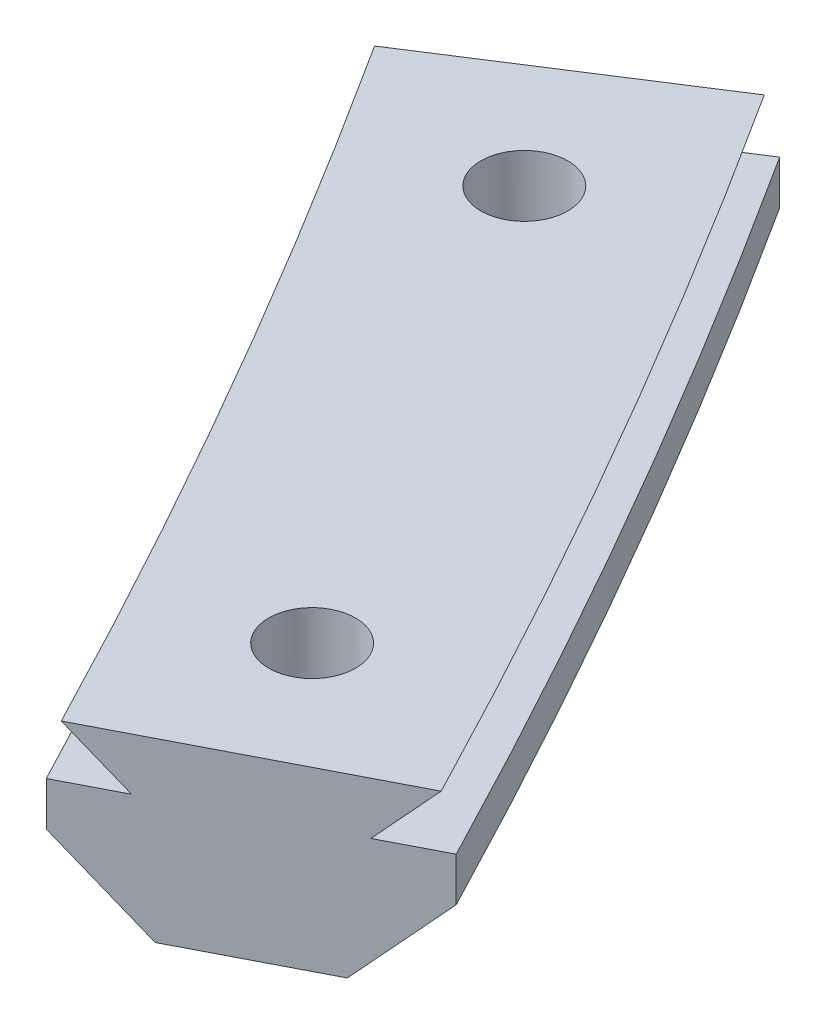
ISO-10303-21;
HEADER;
FILE_DESCRIPTION(('STEP AP214'),'2;1');
FILE_NAME('part.step','',(''),(''),'','','');
FILE_SCHEMA(('AUTOMOTIVE_DESIGN { 1 0 10303 214 1 1 1 1 }'));
ENDSEC;
DATA;
#1=APPLICATION_CONTEXT('core data for automotive mechanical design processes');
#2=APPLICATION_PROTOCOL_DEFINITION('international standard','automotive_design',2000,#1);
#3=PRODUCT_CONTEXT('',#1,'mechanical');
#4=PRODUCT('Part','Part','',(#3));
#5=PRODUCT_RELATED_PRODUCT_CATEGORY('part','',(#4));
#6=PRODUCT_DEFINITION_FORMATION('','',#4);
#7=PRODUCT_DEFINITION_CONTEXT('part definition',#1,'design');
#8=PRODUCT_DEFINITION('design','',#6,#7);
#9=PRODUCT_DEFINITION_SHAPE('','',#8);
#10=(LENGTH_UNIT() NAMED_UNIT(*) SI_UNIT(.MILLI.,.METRE.));
#11=(NAMED_UNIT(*) PLANE_ANGLE_UNIT() SI_UNIT($,.RADIAN.));
#12=(NAMED_UNIT(*) SI_UNIT($,.STERADIAN.) SOLID_ANGLE_UNIT());
#13=UNCERTAINTY_MEASURE_WITH_UNIT(LENGTH_MEASURE(1.E-05),#10,'distance_accuracy_value','');
#14=(GEOMETRIC_REPRESENTATION_CONTEXT(3) GLOBAL_UNCERTAINTY_ASSIGNED_CONTEXT((#13)) GLOBAL_UNIT_ASSIGNED_CONTEXT((#10,
#11,#12)) REPRESENTATION_CONTEXT('',''));
#15=CARTESIAN_POINT('',(0.,0.,0.));
#16=DIRECTION('',(0.,0.,1.));
#17=DIRECTION('',(1.,0.,0.));
#18=AXIS2_PLACEMENT_3D('',#15,#16,#17);
#19=CARTESIAN_POINT('',(581.727271778564,-1.28282801048485E-12,-165.830742679956));
#20=DIRECTION('',(0.,1.,0.));
#21=DIRECTION('',(-1.,0.,0.));
#22=AXIS2_PLACEMENT_3D('',#19,#20,#21);
#23=CYLINDRICAL_SURFACE('',#22,1.49999999999996);
#24=CARTESIAN_POINT('',(581.727271778564,6.09999999999939,-165.830742679956));
#25=DIRECTION('',(0.,1.,0.));
#26=DIRECTION('',(-1.,0.,0.));
#27=AXIS2_PLACEMENT_3D('',#24,#25,#26);
#28=CIRCLE('',#27,1.49999999999996);
#29=CARTESIAN_POINT('',(580.227271778564,6.09999999999939,-165.830742679956));
#30=VERTEX_POINT('',#29);
#31=EDGE_CURVE('E550',#30,#30,#28,.T.);
#32=ORIENTED_EDGE('',*,*,#31,.T.);
#33=EDGE_LOOP('',(#32));
#34=FACE_BOUND('',#33,.T.);
#35=CARTESIAN_POINT('',(581.727271778564,2.99999999999939,-165.830742679956));
#36=DIRECTION('',(0.,-1.,0.));
#37=DIRECTION('',(1.,0.,0.));
#38=AXIS2_PLACEMENT_3D('',#35,#36,#37);
#39=CIRCLE('',#38,1.49999999999996);
#40=CARTESIAN_POINT('',(583.227271778564,2.99999999999939,-165.830742679956));
#41=VERTEX_POINT('',#40);
#42=EDGE_CURVE('E535',#41,#41,#39,.F.);
#43=ORIENTED_EDGE('',*,*,#42,.F.);
#44=EDGE_LOOP('',(#43));
#45=FACE_BOUND('',#44,.T.);
#46=ADVANCED_FACE('F38',(#34,#45),#23,.F.);
#47=CARTESIAN_POINT('',(591.727271778564,-1.29323635134071E-12,-148.510234604267));
#48=DIRECTION('',(0.,1.,0.));
#49=DIRECTION('',(-1.,0.,0.));
#50=AXIS2_PLACEMENT_3D('',#47,#48,#49);
#51=CYLINDRICAL_SURFACE('',#50,1.49999999999996);
#52=CARTESIAN_POINT('',(591.727271778564,6.09999999999938,-148.510234604267));
#53=DIRECTION('',(0.,1.,0.));
#54=DIRECTION('',(-1.,0.,0.));
#55=AXIS2_PLACEMENT_3D('',#52,#53,#54);
#56=CIRCLE('',#55,1.49999999999996);
#57=CARTESIAN_POINT('',(590.227271778564,6.09999999999938,-148.510234604267));
#58=VERTEX_POINT('',#57);
#59=EDGE_CURVE('E522',#58,#58,#56,.T.);
#60=ORIENTED_EDGE('',*,*,#59,.T.);
#61=EDGE_LOOP('',(#60));
#62=FACE_BOUND('',#61,.T.);
#63=CARTESIAN_POINT('',(591.727271778564,2.99999999999938,-148.510234604267));
#64=DIRECTION('',(0.,-1.,0.));
#65=DIRECTION('',(1.,0.,0.));
#66=AXIS2_PLACEMENT_3D('',#63,#64,#65);
#67=CIRCLE('',#66,1.49999999999996);
#68=CARTESIAN_POINT('',(593.227271778564,2.99999999999937,-148.510234604267));
#69=VERTEX_POINT('',#68);
#70=EDGE_CURVE('E437',#69,#69,#67,.F.);
#71=ORIENTED_EDGE('',*,*,#70,.F.);
#72=EDGE_LOOP('',(#71));
#73=FACE_BOUND('',#72,.T.);
#74=ADVANCED_FACE('F449',(#62,#73),#51,.F.);
#75=CARTESIAN_POINT('',(-2.46065352773282,0.,0.));
#76=DIRECTION('',(0.,1.,0.));
#77=DIRECTION('',(-1.,0.,0.));
#78=AXIS2_PLACEMENT_3D('',#75,#76,#77);
#79=PLANE('',#78);
#80=CARTESIAN_POINT('',(314.5,-3.30031141304588E-13,0.));
#81=DIRECTION('',(0.,-1.,0.));
#82=DIRECTION('',(-1.,0.,0.));
#83=AXIS2_PLACEMENT_3D('',#80,#81,#82);
#84=CIRCLE('',#83,316.960653527733);
#85=CARTESIAN_POINT('',(584.79480740583,-6.14814246764911E-13,-165.543870240408));
#86=VERTEX_POINT('',#85);
#87=CARTESIAN_POINT('',(593.012600771902,-6.24799165199513E-13,-151.310234604267));
#88=VERTEX_POINT('',#87);
#89=EDGE_CURVE('E513',#86,#88,#84,.T.);
#90=ORIENTED_EDGE('',*,*,#89,.T.);
#91=DIRECTION('',(1.,0.,0.));
#92=VECTOR('',#91,1.);
#93=CARTESIAN_POINT('',(590.110691024833,-6.21741707760846E-13,-151.310234604267));
#94=LINE('',#93,#92);
#95=CARTESIAN_POINT('',(590.110691024833,-6.21741707760846E-13,-151.310234604267));
#96=VERTEX_POINT('',#95);
#97=EDGE_CURVE('E245',#96,#88,#94,.T.);
#98=ORIENTED_EDGE('',*,*,#97,.F.);
#99=DIRECTION('',(-0.500000000000013,0.,0.866025403784431));
#100=VECTOR('',#99,1.);
#101=CARTESIAN_POINT('',(376.448601376743,-3.92293517173956E-13,218.763360317548));
#102=LINE('',#101,#100);
#103=CARTESIAN_POINT('',(588.720274830606,-6.20276762705206E-13,-148.901963112199));
#104=VERTEX_POINT('',#103);
#105=EDGE_CURVE('E529',#96,#104,#102,.T.);
#106=ORIENTED_EDGE('',*,*,#105,.T.);
#107=CARTESIAN_POINT('',(314.5,-3.23959609138669E-13,0.));
#108=DIRECTION('',(0.,-1.,0.));
#109=DIRECTION('',(-1.,0.,0.));
#110=AXIS2_PLACEMENT_3D('',#107,#108,#109);
#111=CIRCLE('',#110,312.039346472267);
#112=CARTESIAN_POINT('',(580.563020143841,-6.11682264187002E-13,-163.030742679955));
#113=VERTEX_POINT('',#112);
#114=EDGE_CURVE('E586',#113,#104,#111,.T.);
#115=ORIENTED_EDGE('',*,*,#114,.F.);
#116=DIRECTION('',(-1.,0.,0.));
#117=VECTOR('',#116,1.);
#118=CARTESIAN_POINT('',(583.343852532295,-6.14612154298281E-13,-163.030742679955));
#119=LINE('',#118,#117);
#120=CARTESIAN_POINT('',(583.343852532295,-6.14612154298281E-13,-163.030742679955));
#121=VERTEX_POINT('',#120);
#122=EDGE_CURVE('E308',#121,#113,#119,.T.);
#123=ORIENTED_EDGE('',*,*,#122,.F.);
#124=DIRECTION('',(0.499999999999995,0.,-0.866025403784442));
#125=VECTOR('',#124,1.);
#126=CARTESIAN_POINT('',(366.298343637949,-3.81599186980123E-13,212.9031062797));
#127=LINE('',#126,#125);
#128=EDGE_CURVE('E518',#121,#86,#127,.T.);
#129=ORIENTED_EDGE('',*,*,#128,.T.);
#130=EDGE_LOOP('',(#90,#98,#106,#115,#123,#129));
#131=FACE_BOUND('',#130,.T.);
#132=ADVANCED_FACE('F456',(#131),#79,.F.);
#133=CARTESIAN_POINT('',(581.126978647833,-6.10949815649774E-13,-171.388769007353));
#134=VERTEX_POINT('',#133);
#135=CARTESIAN_POINT('',(582.879821350142,-6.14123250192604E-13,-168.630742679956));
#136=VERTEX_POINT('',#135);
#137=EDGE_CURVE('E506',#134,#136,#84,.T.);
#138=ORIENTED_EDGE('',*,*,#137,.T.);
#139=DIRECTION('',(1.,0.,0.));
#140=VECTOR('',#139,1.);
#141=CARTESIAN_POINT('',(580.110691024833,-6.11205689396544E-13,-168.630742679956));
#142=LINE('',#141,#140);
#143=CARTESIAN_POINT('',(580.110691024833,-6.11205689396544E-13,-168.630742679956));
#144=VERTEX_POINT('',#143);
#145=EDGE_CURVE('E287',#144,#136,#142,.T.);
#146=ORIENTED_EDGE('',*,*,#145,.F.);
#147=DIRECTION('',(-0.499999999999984,0.,0.866025403784448));
#148=VECTOR('',#147,1.);
#149=CARTESIAN_POINT('',(361.448601376763,-3.76489489627524E-13,210.103106279698));
#150=LINE('',#149,#148);
#151=CARTESIAN_POINT('',(578.653507789658,-6.09670398463949E-13,-166.106827280695));
#152=VERTEX_POINT('',#151);
#153=EDGE_CURVE('E521',#144,#152,#150,.T.);
#154=ORIENTED_EDGE('',*,*,#153,.T.);
#155=CARTESIAN_POINT('',(576.9871801694,-6.00516584204528E-13,-168.727691839711));
#156=VERTEX_POINT('',#155);
#157=EDGE_CURVE('E582',#156,#152,#111,.T.);
#158=ORIENTED_EDGE('',*,*,#157,.F.);
#159=DIRECTION('',(0.84119898063153,0.,-0.540725692920611));
#160=VECTOR('',#159,1.);
#161=CARTESIAN_POINT('',(90.2136573525786,0.,144.172057780678));
#162=LINE('',#161,#160);
#163=EDGE_CURVE('E614',#156,#134,#162,.T.);
#164=ORIENTED_EDGE('',*,*,#163,.T.);
#165=EDGE_LOOP('',(#138,#146,#154,#158,#164));
#166=FACE_BOUND('',#165,.T.);
#167=ADVANCED_FACE('F708',(#166),#79,.F.);
#168=CARTESIAN_POINT('',(91.9548544826173,0.,143.052810080277));
#169=DIRECTION('',(0.540725692920611,0.,0.84119898063153));
#170=DIRECTION('',(0.84119898063153,0.,-0.540725692920611));
#171=AXIS2_PLACEMENT_3D('',#168,#169,#170);
#172=PLANE('',#171);
#173=DIRECTION('',(0.,-1.,0.));
#174=VECTOR('',#173,1.);
#175=CARTESIAN_POINT('',(574.640784760301,2.78934647226654,-167.219420535699));
#176=LINE('',#175,#174);
#177=CARTESIAN_POINT('',(574.640784760301,4.2999999999994,-167.219420535699));
#178=VERTEX_POINT('',#177);
#179=CARTESIAN_POINT('',(574.640784760301,2.78934647226655,-167.219420535699));
#180=VERTEX_POINT('',#179);
#181=EDGE_CURVE('E722',#178,#180,#176,.T.);
#182=ORIENTED_EDGE('',*,*,#181,.F.);
#183=DIRECTION('',(-0.84119898063153,0.,0.540725692920611));
#184=VECTOR('',#183,1.);
#185=CARTESIAN_POINT('',(95.6698370389488,4.2999999999999,140.664806096425));
#186=LINE('',#185,#184);
#187=CARTESIAN_POINT('',(576.47880453298,4.29999999999934,-168.40090617473));
#188=VERTEX_POINT('',#187);
#189=EDGE_CURVE('E645',#188,#178,#186,.T.);
#190=ORIENTED_EDGE('',*,*,#189,.F.);
#191=DIRECTION('',(-0.594817503531769,0.707106781186544,0.382350804225961));
#192=VECTOR('',#191,1.);
#193=CARTESIAN_POINT('',(314.5,315.734999999996,0.));
#194=LINE('',#193,#192);
#195=CARTESIAN_POINT('',(574.964646367844,6.0999999999994,-167.427599927473));
#196=VERTEX_POINT('',#195);
#197=EDGE_CURVE('E641',#196,#188,#194,.F.);
#198=ORIENTED_EDGE('',*,*,#197,.F.);
#199=DIRECTION('',(-0.84119898063153,0.,0.540725692920611));
#200=VECTOR('',#199,1.);
#201=CARTESIAN_POINT('',(95.3974049848178,6.0999999999999,140.839926388574));
#202=LINE('',#201,#200);
#203=CARTESIAN_POINT('',(583.149512449389,6.09999999999938,-172.688860919591));
#204=VERTEX_POINT('',#203);
#205=EDGE_CURVE('E635',#204,#196,#202,.T.);
#206=ORIENTED_EDGE('',*,*,#205,.F.);
#207=DIRECTION('',(0.594817503531772,0.707106781186541,-0.382350804225962));
#208=VECTOR('',#207,1.);
#209=CARTESIAN_POINT('',(314.5,-313.264999999995,0.));
#210=LINE('',#209,#208);
#211=CARTESIAN_POINT('',(581.635354284252,4.29999999999939,-171.715554672334));
#212=VERTEX_POINT('',#211);
#213=EDGE_CURVE('E712',#212,#204,#210,.T.);
#214=ORIENTED_EDGE('',*,*,#213,.F.);
#215=DIRECTION('',(-0.84119898063153,0.,0.540725692920611));
#216=VECTOR('',#215,1.);
#217=CARTESIAN_POINT('',(88.2398719262858,4.2999999999999,145.440814064129));
#218=LINE('',#217,#216);
#219=CARTESIAN_POINT('',(583.473374056932,4.29999999999938,-172.897040311365));
#220=VERTEX_POINT('',#219);
#221=EDGE_CURVE('E607',#220,#212,#218,.T.);
#222=ORIENTED_EDGE('',*,*,#221,.F.);
#223=DIRECTION('',(0.,-1.,0.));
#224=VECTOR('',#223,1.);
#225=CARTESIAN_POINT('',(583.473374056932,2.78934647226653,-172.897040311365));
#226=LINE('',#225,#224);
#227=CARTESIAN_POINT('',(583.473374056932,2.78934647226653,-172.897040311365));
#228=VERTEX_POINT('',#227);
#229=EDGE_CURVE('E498',#228,#220,#226,.F.);
#230=ORIENTED_EDGE('',*,*,#229,.F.);
#231=DIRECTION('',(0.594817503531767,0.707106781186547,-0.382350804225959));
#232=VECTOR('',#231,1.);
#233=CARTESIAN_POINT('',(314.5,-316.960653527733,0.));
#234=LINE('',#233,#232);
#235=EDGE_CURVE('E618',#134,#228,#234,.T.);
#236=ORIENTED_EDGE('',*,*,#235,.F.);
#237=ORIENTED_EDGE('',*,*,#163,.F.);
#238=DIRECTION('',(-0.594817503531765,0.707106781186549,0.382350804225958));
#239=VECTOR('',#238,1.);
#240=CARTESIAN_POINT('',(314.5,312.039346472268,0.));
#241=LINE('',#240,#239);
#242=EDGE_CURVE('E438',#180,#156,#241,.F.);
#243=ORIENTED_EDGE('',*,*,#242,.F.);
#244=EDGE_LOOP('',(#182,#190,#198,#206,#214,#222,#230,#236,#237,#243));
#245=FACE_BOUND('',#244,.T.);
#246=ADVANCED_FACE('F365',(#245),#172,.F.);
#247=CARTESIAN_POINT('',(66.0102051464209,0.,128.073659801994));
#248=DIRECTION('',(0.458136840404174,0.,0.888881676863957));
#249=DIRECTION('',(0.888881676863957,0.,-0.458136840404174));
#250=AXIS2_PLACEMENT_3D('',#247,#248,#249);
#251=PLANE('',#250);
#252=DIRECTION('',(0.,-1.,0.));
#253=VECTOR('',#252,1.);
#254=CARTESIAN_POINT('',(589.386658570179,2.78934647226653,-141.678817894991));
#255=LINE('',#254,#253);
#256=CARTESIAN_POINT('',(589.386658570179,4.29999999999938,-141.678817894991));
#257=VERTEX_POINT('',#256);
#258=CARTESIAN_POINT('',(589.386658570179,2.78934647226653,-141.678817894991));
#259=VERTEX_POINT('',#258);
#260=EDGE_CURVE('E575',#257,#259,#255,.T.);
#261=ORIENTED_EDGE('',*,*,#260,.T.);
#262=DIRECTION('',(-0.628534261382972,0.707106781186549,0.32395166656117));
#263=VECTOR('',#262,1.);
#264=CARTESIAN_POINT('',(314.5,312.039346472268,1.12529409619818E-13));
#265=LINE('',#264,#263);
#266=CARTESIAN_POINT('',(591.866057539802,-6.16192996726003E-13,-142.956720274588));
#267=VERTEX_POINT('',#266);
#268=EDGE_CURVE('E579',#259,#267,#265,.F.);
#269=ORIENTED_EDGE('',*,*,#268,.T.);
#270=DIRECTION('',(0.888881676863957,0.,-0.458136840404174));
#271=VECTOR('',#270,1.);
#272=CARTESIAN_POINT('',(64.066016623966,0.,129.07571036734));
#273=LINE('',#272,#271);
#274=CARTESIAN_POINT('',(596.240517207627,-6.26873467631332E-13,-145.211352339638));
#275=VERTEX_POINT('',#274);
#276=EDGE_CURVE('E538',#267,#275,#273,.T.);
#277=ORIENTED_EDGE('',*,*,#276,.T.);
#278=DIRECTION('',(0.628534261382975,0.707106781186547,-0.32395166656117));
#279=VECTOR('',#278,1.);
#280=CARTESIAN_POINT('',(314.5,-316.960653527733,1.12529409619818E-13));
#281=LINE('',#280,#279);
#282=CARTESIAN_POINT('',(598.71991617725,2.78934647226648,-146.489254719234));
#283=VERTEX_POINT('',#282);
#284=EDGE_CURVE('E543',#275,#283,#281,.T.);
#285=ORIENTED_EDGE('',*,*,#284,.T.);
#286=DIRECTION('',(0.,-1.,0.));
#287=VECTOR('',#286,1.);
#288=CARTESIAN_POINT('',(598.71991617725,2.78934647226652,-146.489254719234));
#289=LINE('',#288,#287);
#290=CARTESIAN_POINT('',(598.71991617725,4.29999999999936,-146.489254719234));
#291=VERTEX_POINT('',#290);
#292=EDGE_CURVE('E501',#283,#291,#289,.F.);
#293=ORIENTED_EDGE('',*,*,#292,.T.);
#294=DIRECTION('',(-0.888881676863957,0.,0.458136840404174));
#295=VECTOR('',#294,1.);
#296=CARTESIAN_POINT('',(61.8621243102324,4.29999999999993,130.211614377385));
#297=LINE('',#296,#295);
#298=CARTESIAN_POINT('',(596.777709713303,4.29999999999937,-145.488225722951));
#299=VERTEX_POINT('',#298);
#300=EDGE_CURVE('E555',#291,#299,#297,.T.);
#301=ORIENTED_EDGE('',*,*,#300,.T.);
#302=DIRECTION('',(0.62853426138298,0.707106781186541,-0.323951666561173));
#303=VECTOR('',#302,1.);
#304=CARTESIAN_POINT('',(314.5,-313.264999999995,1.12529409619818E-13));
#305=LINE('',#304,#303);
#306=CARTESIAN_POINT('',(598.377696731658,6.09999999999933,-146.312872035679));
#307=VERTEX_POINT('',#306);
#308=EDGE_CURVE('E559',#299,#307,#305,.T.);
#309=ORIENTED_EDGE('',*,*,#308,.T.);
#310=DIRECTION('',(-0.888881676863957,0.,0.458136840404174));
#311=VECTOR('',#310,1.);
#312=CARTESIAN_POINT('',(69.8540933879556,6.09999999999993,126.092488562131));
#313=LINE('',#312,#311);
#314=CARTESIAN_POINT('',(589.728878015771,6.09999999999939,-141.855200578546));
#315=VERTEX_POINT('',#314);
#316=EDGE_CURVE('E563',#307,#315,#313,.T.);
#317=ORIENTED_EDGE('',*,*,#316,.T.);
#318=DIRECTION('',(-0.628534261382977,0.707106781186544,0.323951666561172));
#319=VECTOR('',#318,1.);
#320=CARTESIAN_POINT('',(314.5,315.734999999996,1.12529409619818E-13));
#321=LINE('',#320,#319);
#322=CARTESIAN_POINT('',(591.328865034127,4.29999999999939,-142.679846891274));
#323=VERTEX_POINT('',#322);
#324=EDGE_CURVE('E567',#315,#323,#321,.F.);
#325=ORIENTED_EDGE('',*,*,#324,.T.);
#326=DIRECTION('',(-0.888881676863957,0.,0.458136840404174));
#327=VECTOR('',#326,1.);
#328=CARTESIAN_POINT('',(70.1582859826094,4.29999999999993,125.935705226603));
#329=LINE('',#328,#327);
#330=EDGE_CURVE('E571',#323,#257,#329,.T.);
#331=ORIENTED_EDGE('',*,*,#330,.T.);
#332=EDGE_LOOP('',(#261,#269,#277,#285,#293,#301,#309,#317,#325,#331));
#333=FACE_BOUND('',#332,.T.);
#334=ADVANCED_FACE('F461',(#333),#251,.T.);
#335=CARTESIAN_POINT('',(314.5,2.78934647226682,0.));
#336=DIRECTION('',(0.,-1.,0.));
#337=DIRECTION('',(1.,0.,0.));
#338=AXIS2_PLACEMENT_3D('',#335,#336,#337);
#339=CYLINDRICAL_SURFACE('',#338,309.25);
#340=CARTESIAN_POINT('',(314.5,4.29999999999967,0.));
#341=DIRECTION('',(0.,-1.,0.));
#342=DIRECTION('',(-1.,0.,0.));
#343=AXIS2_PLACEMENT_3D('',#340,#341,#342);
#344=CIRCLE('',#343,309.25);
#345=EDGE_CURVE('E591',#178,#257,#344,.T.);
#346=ORIENTED_EDGE('',*,*,#345,.F.);
#347=ORIENTED_EDGE('',*,*,#181,.T.);
#348=CARTESIAN_POINT('',(314.5,2.78934647226682,0.));
#349=DIRECTION('',(0.,-1.,0.));
#350=DIRECTION('',(-1.,0.,0.));
#351=AXIS2_PLACEMENT_3D('',#348,#349,#350);
#352=CIRCLE('',#351,309.25);
#353=EDGE_CURVE('E588',#180,#259,#352,.T.);
#354=ORIENTED_EDGE('',*,*,#353,.T.);
#355=ORIENTED_EDGE('',*,*,#260,.F.);
#356=EDGE_LOOP('',(#346,#347,#354,#355));
#357=FACE_BOUND('',#356,.T.);
#358=ADVANCED_FACE('F364',(#357),#339,.F.);
#359=CARTESIAN_POINT('',(5.25,4.3,0.));
#360=DIRECTION('',(0.,-1.,0.));
#361=DIRECTION('',(1.,0.,0.));
#362=AXIS2_PLACEMENT_3D('',#359,#360,#361);
#363=PLANE('',#362);
#364=CARTESIAN_POINT('',(314.5,4.29999999999967,0.));
#365=DIRECTION('',(0.,-1.,0.));
#366=DIRECTION('',(-1.,0.,0.));
#367=AXIS2_PLACEMENT_3D('',#364,#365,#366);
#368=CIRCLE('',#367,311.435);
#369=EDGE_CURVE('E594',#188,#323,#368,.T.);
#370=ORIENTED_EDGE('',*,*,#369,.F.);
#371=ORIENTED_EDGE('',*,*,#189,.T.);
#372=ORIENTED_EDGE('',*,*,#345,.T.);
#373=ORIENTED_EDGE('',*,*,#330,.F.);
#374=EDGE_LOOP('',(#370,#371,#372,#373));
#375=FACE_BOUND('',#374,.T.);
#376=ADVANCED_FACE('F467',(#375),#363,.F.);
#377=CARTESIAN_POINT('',(314.5,4.29999999999967,0.));
#378=DIRECTION('',(0.,-1.,0.));
#379=DIRECTION('',(1.,0.,0.));
#380=AXIS2_PLACEMENT_3D('',#377,#378,#379);
#381=CONICAL_SURFACE('',#380,311.435,0.785398163397454);
#382=CARTESIAN_POINT('',(314.5,6.09999999999968,0.));
#383=DIRECTION('',(0.,-1.,0.));
#384=DIRECTION('',(-1.,0.,0.));
#385=AXIS2_PLACEMENT_3D('',#382,#383,#384);
#386=CIRCLE('',#385,309.635);
#387=EDGE_CURVE('E597',#196,#315,#386,.T.);
#388=ORIENTED_EDGE('',*,*,#387,.F.);
#389=ORIENTED_EDGE('',*,*,#197,.T.);
#390=ORIENTED_EDGE('',*,*,#369,.T.);
#391=ORIENTED_EDGE('',*,*,#324,.F.);
#392=EDGE_LOOP('',(#388,#389,#390,#391));
#393=FACE_BOUND('',#392,.T.);
#394=ADVANCED_FACE('F471',(#393),#381,.F.);
#395=CARTESIAN_POINT('',(4.86500000000002,6.09999999999999,0.));
#396=DIRECTION('',(0.,-1.,0.));
#397=DIRECTION('',(1.,0.,0.));
#398=AXIS2_PLACEMENT_3D('',#395,#396,#397);
#399=PLANE('',#398);
#400=ORIENTED_EDGE('',*,*,#59,.F.);
#401=EDGE_LOOP('',(#400));
#402=FACE_BOUND('',#401,.T.);
#403=ORIENTED_EDGE('',*,*,#31,.F.);
#404=EDGE_LOOP('',(#403));
#405=FACE_BOUND('',#404,.T.);
#406=CARTESIAN_POINT('',(314.5,6.09999999999966,0.));
#407=DIRECTION('',(0.,-1.,0.));
#408=DIRECTION('',(-1.,0.,0.));
#409=AXIS2_PLACEMENT_3D('',#406,#407,#408);
#410=CIRCLE('',#409,319.365);
#411=EDGE_CURVE('E600',#204,#307,#410,.T.);
#412=ORIENTED_EDGE('',*,*,#411,.F.);
#413=ORIENTED_EDGE('',*,*,#205,.T.);
#414=ORIENTED_EDGE('',*,*,#387,.T.);
#415=ORIENTED_EDGE('',*,*,#316,.F.);
#416=EDGE_LOOP('',(#412,#413,#414,#415));
#417=FACE_BOUND('',#416,.T.);
#418=ADVANCED_FACE('F475',(#402,#405,#417),#399,.F.);
#419=CARTESIAN_POINT('',(314.5,6.09999999999966,0.));
#420=DIRECTION('',(0.,1.,0.));
#421=DIRECTION('',(-1.,0.,0.));
#422=AXIS2_PLACEMENT_3D('',#419,#420,#421);
#423=CONICAL_SURFACE('',#422,319.365,0.785398163397456);
#424=CARTESIAN_POINT('',(314.5,4.29999999999967,0.));
#425=DIRECTION('',(0.,-1.,0.));
#426=DIRECTION('',(-1.,0.,0.));
#427=AXIS2_PLACEMENT_3D('',#424,#425,#426);
#428=CIRCLE('',#427,317.565);
#429=EDGE_CURVE('E510',#212,#299,#428,.T.);
#430=ORIENTED_EDGE('',*,*,#429,.F.);
#431=ORIENTED_EDGE('',*,*,#213,.T.);
#432=ORIENTED_EDGE('',*,*,#411,.T.);
#433=ORIENTED_EDGE('',*,*,#308,.F.);
#434=EDGE_LOOP('',(#430,#431,#432,#433));
#435=FACE_BOUND('',#434,.T.);
#436=ADVANCED_FACE('F479',(#435),#423,.T.);
#437=CARTESIAN_POINT('',(-5.25,4.3,0.));
#438=DIRECTION('',(0.,-1.,0.));
#439=DIRECTION('',(1.,0.,0.));
#440=AXIS2_PLACEMENT_3D('',#437,#438,#439);
#441=PLANE('',#440);
#442=CARTESIAN_POINT('',(314.5,4.29999999999966,0.));
#443=DIRECTION('',(0.,-1.,0.));
#444=DIRECTION('',(-1.,0.,0.));
#445=AXIS2_PLACEMENT_3D('',#442,#443,#444);
#446=CIRCLE('',#445,319.75);
#447=EDGE_CURVE('E505',#220,#291,#446,.T.);
#448=ORIENTED_EDGE('',*,*,#447,.F.);
#449=ORIENTED_EDGE('',*,*,#221,.T.);
#450=ORIENTED_EDGE('',*,*,#429,.T.);
#451=ORIENTED_EDGE('',*,*,#300,.F.);
#452=EDGE_LOOP('',(#448,#449,#450,#451));
#453=FACE_BOUND('',#452,.T.);
#454=ADVANCED_FACE('F483',(#453),#441,.F.);
#455=CARTESIAN_POINT('',(314.5,2.78934647226682,0.));
#456=DIRECTION('',(0.,-1.,0.));
#457=DIRECTION('',(1.,0.,0.));
#458=AXIS2_PLACEMENT_3D('',#455,#456,#457);
#459=CYLINDRICAL_SURFACE('',#458,319.75);
#460=CARTESIAN_POINT('',(314.5,2.78934647226681,0.));
#461=DIRECTION('',(0.,-1.,0.));
#462=DIRECTION('',(-1.,0.,0.));
#463=AXIS2_PLACEMENT_3D('',#460,#461,#462);
#464=CIRCLE('',#463,319.75);
#465=EDGE_CURVE('E496',#228,#283,#464,.T.);
#466=ORIENTED_EDGE('',*,*,#465,.F.);
#467=ORIENTED_EDGE('',*,*,#229,.T.);
#468=ORIENTED_EDGE('',*,*,#447,.T.);
#469=ORIENTED_EDGE('',*,*,#292,.F.);
#470=EDGE_LOOP('',(#466,#467,#468,#469));
#471=FACE_BOUND('',#470,.T.);
#472=ADVANCED_FACE('F486',(#471),#459,.T.);
#473=CARTESIAN_POINT('',(314.5,2.78934647226681,0.));
#474=DIRECTION('',(0.,1.,0.));
#475=DIRECTION('',(-1.,0.,0.));
#476=AXIS2_PLACEMENT_3D('',#473,#474,#475);
#477=CONICAL_SURFACE('',#476,319.75,0.785398163397448);
#478=CARTESIAN_POINT('',(594.96054875608,0.393013201866161,-148.510034604267));
#479=CARTESIAN_POINT('',(594.691123328428,0.373287531383626,-148.97669313381));
#480=CARTESIAN_POINT('',(594.421676306922,0.35493221860184,-149.443389065006));
#481=CARTESIAN_POINT('',(593.882739075643,0.320962308404499,-150.376855731673));
#482=CARTESIAN_POINT('',(593.613248865869,0.305347710994634,-150.843626467143));
#483=CARTESIAN_POINT('',(593.343737062241,0.29110347129121,-151.310434604267));
#484=B_SPLINE_CURVE_WITH_KNOTS('',3,(#478,#479,#480,#481,#482,#483),.UNSPECIFIED.,.F.,.F.,(4,2,
4),(0.,1.61761965984135,3.2352393230417),.UNSPECIFIED.);
#485=CARTESIAN_POINT('',(594.960433286026,0.39300474832865,-148.510234604267));
#486=VERTEX_POINT('',#485);
#487=CARTESIAN_POINT('',(593.343852532295,0.291109573829679,-151.310234604267));
#488=VERTEX_POINT('',#487);
#489=EDGE_CURVE('E11',#486,#488,#484,.T.);
#490=ORIENTED_EDGE('',*,*,#489,.T.);
#491=CARTESIAN_POINT('',(599.089398657059,5.35272336498104,-151.310234604267));
#492=CARTESIAN_POINT('',(598.099570108837,4.47874598663684,-151.310234604267));
#493=CARTESIAN_POINT('',(597.109243292585,3.60533284634086,-151.310234604267));
#494=CARTESIAN_POINT('',(595.127567372469,1.85966998614558,-151.310234604267));
#495=CARTESIAN_POINT('',(594.136218270095,0.987420264555087,-151.310234604267));
#496=CARTESIAN_POINT('',(592.152469071586,-0.755883422742379,-151.310234604267));
#497=CARTESIAN_POINT('',(591.160068975372,-1.62693738836028,-151.310234604267));
#498=CARTESIAN_POINT('',(589.174187782601,-3.36781508473083,-151.310234604267));
#499=CARTESIAN_POINT('',(588.180706684471,-4.23763881369131,-151.310234604267));
#500=CARTESIAN_POINT('',(587.186671489373,-5.10682894969279,-151.310234604267));
#501=B_SPLINE_CURVE_WITH_KNOTS('',3,(#491,#492,#493,#494,#495,#496,#497,#498,#499,#500),
.UNSPECIFIED.,.F.,.F.,(4,2,2,2,4),(0.,3.96135986841997,7.92271397210194,11.8840683708222,
15.8454285343457),.UNSPECIFIED.);
#502=EDGE_CURVE('E429',#488,#88,#501,.T.);
#503=ORIENTED_EDGE('',*,*,#502,.T.);
#504=ORIENTED_EDGE('',*,*,#89,.F.);
#505=CARTESIAN_POINT('',(584.794693601039,-0.000200000000616315,-165.543673124728));
#506=CARTESIAN_POINT('',(584.822337759125,0.0483817112407845,-165.591554211066));
#507=CARTESIAN_POINT('',(584.849981101088,0.0969652798048169,-165.639433883837));
#508=CARTESIAN_POINT('',(584.905266152768,0.194136131578085,-165.735190402246));
#509=CARTESIAN_POINT('',(584.932907862486,0.24272341478732,-165.783067247884));
#510=CARTESIAN_POINT('',(584.960548756079,0.291312555319187,-165.830942679956));
#511=B_SPLINE_CURVE_WITH_KNOTS('',3,(#505,#506,#507,#508,#509,#510),.UNSPECIFIED.,.F.,.F.,(4,2,
4),(0.,0.220800418898993,0.441600837797715),.UNSPECIFIED.);
#512=CARTESIAN_POINT('',(584.960433286026,0.291109573829754,-165.830742679956));
#513=VERTEX_POINT('',#512);
#514=EDGE_CURVE('E68',#86,#513,#511,.T.);
#515=ORIENTED_EDGE('',*,*,#514,.T.);
#516=CARTESIAN_POINT('',(584.960548756079,0.291103471291283,-165.830542679956));
#517=CARTESIAN_POINT('',(584.691036952451,0.305347710994694,-166.297350817079));
#518=CARTESIAN_POINT('',(584.421546742677,0.320962308404545,-166.76412155255));
#519=CARTESIAN_POINT('',(583.882609511398,0.354932218601858,-167.697588219216));
#520=CARTESIAN_POINT('',(583.613162489892,0.373287531383628,-168.164284150412));
#521=CARTESIAN_POINT('',(583.343737062241,0.393013201866148,-168.630942679956));
#522=B_SPLINE_CURVE_WITH_KNOTS('',3,(#516,#517,#518,#519,#520,#521),.UNSPECIFIED.,.F.,.F.,(4,2,
4),(0.,1.61761966320025,3.23523932304153),.UNSPECIFIED.);
#523=CARTESIAN_POINT('',(583.343852532295,0.393004748328706,-168.630742679956));
#524=VERTEX_POINT('',#523);
#525=EDGE_CURVE('E53',#513,#524,#522,.T.);
#526=ORIENTED_EDGE('',*,*,#525,.T.);
#527=CARTESIAN_POINT('',(588.112604904548,4.44280777821721,-168.630742679956));
#528=CARTESIAN_POINT('',(587.261307363856,3.71809354529069,-168.630742679956));
#529=CARTESIAN_POINT('',(586.409550456998,2.99391884302421,-168.630742679956));
#530=CARTESIAN_POINT('',(584.70509842989,1.5466774637432,-168.630742679956));
#531=CARTESIAN_POINT('',(583.852403311302,0.823610784770272,-168.630742679956));
#532=CARTESIAN_POINT('',(582.146052300948,-0.621388204949713,-168.630742679956));
#533=CARTESIAN_POINT('',(581.292396409107,-1.34332051560887,-168.630742679956));
#534=CARTESIAN_POINT('',(579.584100501156,-2.78602289415923,-168.630742679956));
#535=CARTESIAN_POINT('',(578.729460483306,-3.50679295999155,-168.630742679956));
#536=CARTESIAN_POINT('',(577.874318204436,-4.22696671666275,-168.630742679956));
#537=B_SPLINE_CURVE_WITH_KNOTS('',3,(#527,#528,#529,#530,#531,#532,#533,#534,#535,#536),
.UNSPECIFIED.,.F.,.F.,(4,2,2,2,4),(0.,3.35399209005079,6.707978245175,10.0619646601793,
13.4159570101514),.UNSPECIFIED.);
#538=EDGE_CURVE('E674',#524,#136,#537,.T.);
#539=ORIENTED_EDGE('',*,*,#538,.T.);
#540=ORIENTED_EDGE('',*,*,#137,.F.);
#541=ORIENTED_EDGE('',*,*,#235,.T.);
#542=ORIENTED_EDGE('',*,*,#465,.T.);
#543=ORIENTED_EDGE('',*,*,#284,.F.);
#544=CARTESIAN_POINT('',(594.728417694949,-6.2528031680791E-13,-148.108371812374));
#545=VERTEX_POINT('',#544);
#546=EDGE_CURVE('E515',#545,#275,#84,.T.);
#547=ORIENTED_EDGE('',*,*,#546,.F.);
#548=CARTESIAN_POINT('',(594.728299593413,-0.000200000000602158,-148.108167254512));
#549=CARTESIAN_POINT('',(594.767011739142,0.0653573989171232,-148.175218657785));
#550=CARTESIAN_POINT('',(594.805721908895,0.130919464008744,-148.242266638567));
#551=CARTESIAN_POINT('',(594.883138296451,0.262052926539468,-148.376355755152));
#552=CARTESIAN_POINT('',(594.921844514253,0.32762432397857,-148.443396890954));
#553=CARTESIAN_POINT('',(594.96054875608,0.393200387591569,-148.510434604267));
#554=B_SPLINE_CURVE_WITH_KNOTS('',3,(#548,#549,#550,#551,#552,#553),.UNSPECIFIED.,.F.,.F.,(4,2,
4),(0.,0.304352821797042,0.608705643592649),.UNSPECIFIED.);
#555=EDGE_CURVE('E60',#545,#486,#554,.T.);
#556=ORIENTED_EDGE('',*,*,#555,.T.);
#557=EDGE_LOOP('',(#490,#503,#504,#515,#526,#539,#540,#541,#542,#543,#547,#556));
#558=FACE_BOUND('',#557,.T.);
#559=ADVANCED_FACE('F348',(#558),#477,.T.);
#560=CARTESIAN_POINT('',(314.5,-3.23959609138669E-13,0.));
#561=DIRECTION('',(0.,-1.,0.));
#562=DIRECTION('',(1.,0.,0.));
#563=AXIS2_PLACEMENT_3D('',#560,#561,#562);
#564=CONICAL_SURFACE('',#563,312.039346472267,0.785398163397447);
#565=ORIENTED_EDGE('',*,*,#114,.T.);
#566=CARTESIAN_POINT('',(588.720392110831,-0.000200000000598975,-148.902166247507));
#567=CARTESIAN_POINT('',(588.682662922173,0.0641402576299365,-148.836817375823));
#568=CARTESIAN_POINT('',(588.644931885362,0.128476179217312,-148.771465303044));
#569=CARTESIAN_POINT('',(588.569466115434,0.257139350306004,-148.640754755297));
#570=CARTESIAN_POINT('',(588.531731382317,0.32146659980732,-148.575396280329));
#571=CARTESIAN_POINT('',(588.493994801048,0.385789513265476,-148.510034604267));
#572=B_SPLINE_CURVE_WITH_KNOTS('',3,(#566,#567,#568,#569,#570,#571),.UNSPECIFIED.,.F.,.F.,(4,2,
4),(0.,0.297494064237434,0.594988128476078),.UNSPECIFIED.);
#573=CARTESIAN_POINT('',(588.494110271102,0.385592691781535,-148.510234604267));
#574=VERTEX_POINT('',#573);
#575=EDGE_CURVE('E416',#104,#574,#572,.T.);
#576=ORIENTED_EDGE('',*,*,#575,.T.);
#577=CARTESIAN_POINT('',(588.493994801048,0.385598903935517,-148.510434604267));
#578=CARTESIAN_POINT('',(588.763508166398,0.371098689549107,-148.043623762162));
#579=CARTESIAN_POINT('',(589.032999157043,0.355203610916533,-147.576851674182));
#580=CARTESIAN_POINT('',(589.571936388323,0.320623725197604,-146.643385007516));
#581=CARTESIAN_POINT('',(589.841382628957,0.301938918117468,-146.176690428829));
#582=CARTESIAN_POINT('',(590.110806494887,0.281859246797387,-145.710034604267));
#583=B_SPLINE_CURVE_WITH_KNOTS('',3,(#577,#578,#579,#580,#581,#582),.UNSPECIFIED.,.F.,.F.,(4,2,
4),(0.,1.61764893197563,3.23529786034479),.UNSPECIFIED.);
#584=CARTESIAN_POINT('',(590.110691024833,0.281867852079403,-145.710234604267));
#585=VERTEX_POINT('',#584);
#586=EDGE_CURVE('E374',#574,#585,#583,.T.);
#587=ORIENTED_EDGE('',*,*,#586,.T.);
#588=CARTESIAN_POINT('',(585.516776316104,4.33564887796759,-145.710234604267));
#589=CARTESIAN_POINT('',(586.318637023643,3.62939232108231,-145.710234604267));
#590=CARTESIAN_POINT('',(587.120149255982,2.92274015315247,-145.710234604267));
#591=CARTESIAN_POINT('',(588.722490954794,1.50866358048266,-145.710234604267));
#592=CARTESIAN_POINT('',(589.523320421873,0.801239176429854,-145.710234604267));
#593=CARTESIAN_POINT('',(591.124312170635,-0.614364112721388,-145.710234604267));
#594=CARTESIAN_POINT('',(591.924474452343,-1.32254299779164,-145.710234604267));
#595=CARTESIAN_POINT('',(593.524146846636,-2.73963839977402,-145.710234604267));
#596=CARTESIAN_POINT('',(594.32365695864,-3.44855491734144,-145.710234604267));
#597=CARTESIAN_POINT('',(595.122847767533,-4.15783118368718,-145.710234604267));
#598=B_SPLINE_CURVE_WITH_KNOTS('',3,(#588,#589,#590,#591,#592,#593,#594,#595,#596,#597),
.UNSPECIFIED.,.F.,.F.,(4,2,2,2,4),(0.,3.20562150139391,6.41124015260927,9.6168586840653,
12.8224800656818),.UNSPECIFIED.);
#599=CARTESIAN_POINT('',(590.429486061945,-6.22077590797392E-13,-145.710234604267));
#600=VERTEX_POINT('',#599);
#601=EDGE_CURVE('E407',#585,#600,#598,.T.);
#602=ORIENTED_EDGE('',*,*,#601,.T.);
#603=EDGE_CURVE('E587',#600,#267,#111,.T.);
#604=ORIENTED_EDGE('',*,*,#603,.T.);
#605=ORIENTED_EDGE('',*,*,#268,.F.);
#606=ORIENTED_EDGE('',*,*,#353,.F.);
#607=ORIENTED_EDGE('',*,*,#242,.T.);
#608=ORIENTED_EDGE('',*,*,#157,.T.);
#609=CARTESIAN_POINT('',(578.653620876274,-0.000200000000587289,-166.10702315246));
#610=CARTESIAN_POINT('',(578.627018005037,0.0468486716099692,-166.060945627851));
#611=CARTESIAN_POINT('',(578.600414396483,0.0938956753960017,-166.014866826171));
#612=CARTESIAN_POINT('',(578.547205704741,0.187986347319069,-165.922706668669));
#613=CARTESIAN_POINT('',(578.520600621553,0.235030015456103,-165.876625312848));
#614=CARTESIAN_POINT('',(578.493994801048,0.282072015768614,-165.830542679955));
#615=B_SPLINE_CURVE_WITH_KNOTS('',3,(#609,#610,#611,#612,#613,#614),.UNSPECIFIED.,.F.,.F.,(4,2,
4),(0.,0.213072421158313,0.426144842316855),.UNSPECIFIED.);
#616=CARTESIAN_POINT('',(578.494110271102,0.281867852079816,-165.830742679955));
#617=VERTEX_POINT('',#616);
#618=EDGE_CURVE('E680',#152,#617,#615,.T.);
#619=ORIENTED_EDGE('',*,*,#618,.T.);
#620=CARTESIAN_POINT('',(578.493994801048,0.281859246797747,-165.830942679955));
#621=CARTESIAN_POINT('',(578.763418666977,0.301938918117885,-165.364286855394));
#622=CARTESIAN_POINT('',(579.032864907612,0.320623725198055,-164.897592276706));
#623=CARTESIAN_POINT('',(579.571802138891,0.355203610917006,-163.96412561004));
#624=CARTESIAN_POINT('',(579.841293129536,0.371098689549566,-163.497353522061));
#625=CARTESIAN_POINT('',(580.110806494886,0.385598903935939,-163.030542679955));
#626=B_SPLINE_CURVE_WITH_KNOTS('',3,(#620,#621,#622,#623,#624,#625),.UNSPECIFIED.,.F.,.F.,(4,2,
4),(0.,1.61764892836926,3.23529786034498),.UNSPECIFIED.);
#627=CARTESIAN_POINT('',(580.110691024833,0.385592691781945,-163.030742679955));
#628=VERTEX_POINT('',#627);
#629=EDGE_CURVE('E383',#617,#628,#626,.T.);
#630=ORIENTED_EDGE('',*,*,#629,.T.);
#631=CARTESIAN_POINT('',(574.325730388285,5.30096734343364,-163.030742679955));
#632=CARTESIAN_POINT('',(575.333297106635,4.44749764300023,-163.030742679955));
#633=CARTESIAN_POINT('',(576.340172592412,3.59321205877559,-163.030742679955));
#634=CARTESIAN_POINT('',(578.352574833651,1.88305854045957,-163.030742679955));
#635=CARTESIAN_POINT('',(579.358101592267,1.02719061007916,-163.030742679955));
#636=CARTESIAN_POINT('',(581.367844710122,-0.686082076075366,-163.030742679955));
#637=CARTESIAN_POINT('',(582.372061069523,-1.54348683166054,-163.030742679955));
#638=CARTESIAN_POINT('',(584.379220140576,-3.25979061110482,-163.030742679955));
#639=CARTESIAN_POINT('',(585.382162849241,-4.11868963845916,-163.030742679955));
#640=CARTESIAN_POINT('',(586.384484694421,-4.97831246226141,-163.030742679955));
#641=B_SPLINE_CURVE_WITH_KNOTS('',3,(#631,#632,#633,#634,#635,#636,#637,#638,#639,#640),
.UNSPECIFIED.,.F.,.F.,(4,2,2,2,4),(0.,3.96136421351057,7.92271914844284,11.8840735963803,
15.8454373227844),.UNSPECIFIED.);
#642=EDGE_CURVE('E341',#628,#113,#641,.T.);
#643=ORIENTED_EDGE('',*,*,#642,.T.);
#644=EDGE_LOOP('',(#565,#576,#587,#602,#604,#605,#606,#607,#608,#619,#630,#643));
#645=FACE_BOUND('',#644,.T.);
#646=ADVANCED_FACE('F389',(#645),#564,.F.);
#647=ORIENTED_EDGE('',*,*,#603,.F.);
#648=DIRECTION('',(-1.,0.,0.));
#649=VECTOR('',#648,1.);
#650=CARTESIAN_POINT('',(593.343852532295,-6.25148172662583E-13,-145.710234604267));
#651=LINE('',#650,#649);
#652=CARTESIAN_POINT('',(593.343852532295,-6.25148172662583E-13,-145.710234604267));
#653=VERTEX_POINT('',#652);
#654=EDGE_CURVE('E248',#653,#600,#651,.T.);
#655=ORIENTED_EDGE('',*,*,#654,.F.);
#656=DIRECTION('',(0.500000000000014,0.,-0.866025403784431));
#657=VECTOR('',#656,1.);
#658=CARTESIAN_POINT('',(381.298343637936,-3.97403214526562E-13,221.563360317548));
#659=LINE('',#658,#657);
#660=EDGE_CURVE('E526',#653,#545,#659,.T.);
#661=ORIENTED_EDGE('',*,*,#660,.T.);
#662=ORIENTED_EDGE('',*,*,#546,.T.);
#663=ORIENTED_EDGE('',*,*,#276,.F.);
#664=EDGE_LOOP('',(#647,#655,#661,#662,#663));
#665=FACE_BOUND('',#664,.T.);
#666=ADVANCED_FACE('F40',(#665),#79,.F.);
#667=CARTESIAN_POINT('',(583.343852532295,2.99999999999939,-168.630742679956));
#668=DIRECTION('',(0.866025403784439,0.,-0.499999999999999));
#669=DIRECTION('',(-0.499999999999999,0.,-0.866025403784439));
#670=AXIS2_PLACEMENT_3D('',#667,#668,#669);
#671=PLANE('',#670);
#672=DIRECTION('',(0.,-1.,0.));
#673=VECTOR('',#672,1.);
#674=CARTESIAN_POINT('',(584.960433286026,2.99999999999938,-165.830742679956));
#675=LINE('',#674,#673);
#676=CARTESIAN_POINT('',(584.960433286026,2.99999999999938,-165.830742679956));
#677=VERTEX_POINT('',#676);
#678=EDGE_CURVE('E307',#677,#513,#675,.T.);
#679=ORIENTED_EDGE('',*,*,#678,.F.);
#680=DIRECTION('',(0.499999999999999,0.,0.866025403784439));
#681=VECTOR('',#680,1.);
#682=CARTESIAN_POINT('',(583.343852532295,2.99999999999939,-168.630742679956));
#683=LINE('',#682,#681);
#684=CARTESIAN_POINT('',(583.343852532295,2.99999999999939,-168.630742679956));
#685=VERTEX_POINT('',#684);
#686=EDGE_CURVE('E282',#685,#677,#683,.T.);
#687=ORIENTED_EDGE('',*,*,#686,.F.);
#688=DIRECTION('',(0.,-1.,0.));
#689=VECTOR('',#688,1.);
#690=CARTESIAN_POINT('',(583.343852532295,2.99999999999939,-168.630742679956));
#691=LINE('',#690,#689);
#692=EDGE_CURVE('E263',#685,#524,#691,.T.);
#693=ORIENTED_EDGE('',*,*,#692,.T.);
#694=ORIENTED_EDGE('',*,*,#525,.F.);
#695=EDGE_LOOP('',(#679,#687,#693,#694));
#696=FACE_BOUND('',#695,.T.);
#697=ADVANCED_FACE('F358',(#696),#671,.F.);
#698=CARTESIAN_POINT('',(580.110691024833,2.99999999999939,-163.030742679955));
#699=DIRECTION('',(-0.866025403784448,0.,0.499999999999984));
#700=DIRECTION('',(0.499999999999984,0.,0.866025403784448));
#701=AXIS2_PLACEMENT_3D('',#698,#699,#700);
#702=PLANE('',#701);
#703=DIRECTION('',(0.,-1.,0.));
#704=VECTOR('',#703,1.);
#705=CARTESIAN_POINT('',(578.494110271102,2.99999999999939,-165.830742679955));
#706=LINE('',#705,#704);
#707=CARTESIAN_POINT('',(578.494110271102,2.99999999999939,-165.830742679955));
#708=VERTEX_POINT('',#707);
#709=EDGE_CURVE('E320',#708,#617,#706,.T.);
#710=ORIENTED_EDGE('',*,*,#709,.F.);
#711=DIRECTION('',(-0.499999999999984,0.,-0.866025403784448));
#712=VECTOR('',#711,1.);
#713=CARTESIAN_POINT('',(580.110691024833,2.99999999999939,-163.030742679955));
#714=LINE('',#713,#712);
#715=CARTESIAN_POINT('',(580.110691024833,2.99999999999939,-163.030742679955));
#716=VERTEX_POINT('',#715);
#717=EDGE_CURVE('E295',#716,#708,#714,.T.);
#718=ORIENTED_EDGE('',*,*,#717,.F.);
#719=DIRECTION('',(0.,-1.,0.));
#720=VECTOR('',#719,1.);
#721=CARTESIAN_POINT('',(580.110691024833,2.99999999999939,-163.030742679955));
#722=LINE('',#721,#720);
#723=EDGE_CURVE('E324',#716,#628,#722,.T.);
#724=ORIENTED_EDGE('',*,*,#723,.T.);
#725=ORIENTED_EDGE('',*,*,#629,.F.);
#726=EDGE_LOOP('',(#710,#718,#724,#725));
#727=FACE_BOUND('',#726,.T.);
#728=ADVANCED_FACE('F362',(#727),#702,.F.);
#729=CARTESIAN_POINT('',(0.,3.,0.));
#730=DIRECTION('',(0.,-1.,0.));
#731=DIRECTION('',(1.,0.,0.));
#732=AXIS2_PLACEMENT_3D('',#729,#730,#731);
#733=PLANE('',#732);
#734=ORIENTED_EDGE('',*,*,#686,.T.);
#735=DIRECTION('',(-0.499999999999995,0.,0.866025403784442));
#736=VECTOR('',#735,1.);
#737=CARTESIAN_POINT('',(584.960433286026,2.99999999999938,-165.830742679956));
#738=LINE('',#737,#736);
#739=CARTESIAN_POINT('',(583.343852532295,2.99999999999939,-163.030742679955));
#740=VERTEX_POINT('',#739);
#741=EDGE_CURVE('E286',#677,#740,#738,.T.);
#742=ORIENTED_EDGE('',*,*,#741,.T.);
#743=DIRECTION('',(-1.,0.,0.));
#744=VECTOR('',#743,1.);
#745=CARTESIAN_POINT('',(583.343852532295,2.99999999999939,-163.030742679955));
#746=LINE('',#745,#744);
#747=EDGE_CURVE('E291',#740,#716,#746,.T.);
#748=ORIENTED_EDGE('',*,*,#747,.T.);
#749=ORIENTED_EDGE('',*,*,#717,.T.);
#750=DIRECTION('',(0.499999999999984,0.,-0.866025403784448));
#751=VECTOR('',#750,1.);
#752=CARTESIAN_POINT('',(578.494110271102,2.99999999999939,-165.830742679955));
#753=LINE('',#752,#751);
#754=CARTESIAN_POINT('',(580.110691024833,2.99999999999939,-168.630742679956));
#755=VERTEX_POINT('',#754);
#756=EDGE_CURVE('E299',#708,#755,#753,.T.);
#757=ORIENTED_EDGE('',*,*,#756,.T.);
#758=DIRECTION('',(1.,0.,0.));
#759=VECTOR('',#758,1.);
#760=CARTESIAN_POINT('',(580.110691024833,2.99999999999939,-168.630742679956));
#761=LINE('',#760,#759);
#762=EDGE_CURVE('E303',#755,#685,#761,.T.);
#763=ORIENTED_EDGE('',*,*,#762,.T.);
#764=EDGE_LOOP('',(#734,#742,#748,#749,#757,#763));
#765=FACE_BOUND('',#764,.T.);
#766=ORIENTED_EDGE('',*,*,#42,.T.);
#767=EDGE_LOOP('',(#766));
#768=FACE_BOUND('',#767,.T.);
#769=ADVANCED_FACE('F670',(#765,#768),#733,.T.);
#770=CARTESIAN_POINT('',(580.110691024833,2.99999999999939,-168.630742679956));
#771=DIRECTION('',(0.,0.,-1.));
#772=DIRECTION('',(-1.,0.,0.));
#773=AXIS2_PLACEMENT_3D('',#770,#771,#772);
#774=PLANE('',#773);
#775=ORIENTED_EDGE('',*,*,#692,.F.);
#776=ORIENTED_EDGE('',*,*,#762,.F.);
#777=DIRECTION('',(0.,-1.,0.));
#778=VECTOR('',#777,1.);
#779=CARTESIAN_POINT('',(580.110691024833,2.99999999999939,-168.630742679956));
#780=LINE('',#779,#778);
#781=EDGE_CURVE('E316',#755,#144,#780,.T.);
#782=ORIENTED_EDGE('',*,*,#781,.T.);
#783=ORIENTED_EDGE('',*,*,#145,.T.);
#784=ORIENTED_EDGE('',*,*,#538,.F.);
#785=EDGE_LOOP('',(#775,#776,#782,#783,#784));
#786=FACE_BOUND('',#785,.T.);
#787=ADVANCED_FACE('F677',(#786),#774,.F.);
#788=CARTESIAN_POINT('',(578.494110271102,2.99999999999939,-165.830742679955));
#789=DIRECTION('',(-0.866025403784448,0.,-0.499999999999984));
#790=DIRECTION('',(-0.499999999999984,0.,0.866025403784448));
#791=AXIS2_PLACEMENT_3D('',#788,#789,#790);
#792=PLANE('',#791);
#793=ORIENTED_EDGE('',*,*,#153,.F.);
#794=ORIENTED_EDGE('',*,*,#781,.F.);
#795=ORIENTED_EDGE('',*,*,#756,.F.);
#796=ORIENTED_EDGE('',*,*,#709,.T.);
#797=ORIENTED_EDGE('',*,*,#618,.F.);
#798=EDGE_LOOP('',(#793,#794,#795,#796,#797));
#799=FACE_BOUND('',#798,.T.);
#800=ADVANCED_FACE('F697',(#799),#792,.F.);
#801=CARTESIAN_POINT('',(583.343852532295,2.99999999999939,-163.030742679955));
#802=DIRECTION('',(0.,0.,1.));
#803=DIRECTION('',(1.,0.,0.));
#804=AXIS2_PLACEMENT_3D('',#801,#802,#803);
#805=PLANE('',#804);
#806=ORIENTED_EDGE('',*,*,#723,.F.);
#807=ORIENTED_EDGE('',*,*,#747,.F.);
#808=DIRECTION('',(0.,-1.,0.));
#809=VECTOR('',#808,1.);
#810=CARTESIAN_POINT('',(583.343852532295,2.99999999999939,-163.030742679955));
#811=LINE('',#810,#809);
#812=EDGE_CURVE('E328',#740,#121,#811,.T.);
#813=ORIENTED_EDGE('',*,*,#812,.T.);
#814=ORIENTED_EDGE('',*,*,#122,.T.);
#815=ORIENTED_EDGE('',*,*,#642,.F.);
#816=EDGE_LOOP('',(#806,#807,#813,#814,#815));
#817=FACE_BOUND('',#816,.T.);
#818=ADVANCED_FACE('F355',(#817),#805,.F.);
#819=CARTESIAN_POINT('',(584.960433286026,2.99999999999938,-165.830742679956));
#820=DIRECTION('',(0.866025403784442,0.,0.499999999999995));
#821=DIRECTION('',(0.499999999999995,0.,-0.866025403784442));
#822=AXIS2_PLACEMENT_3D('',#819,#820,#821);
#823=PLANE('',#822);
#824=ORIENTED_EDGE('',*,*,#128,.F.);
#825=ORIENTED_EDGE('',*,*,#812,.F.);
#826=ORIENTED_EDGE('',*,*,#741,.F.);
#827=ORIENTED_EDGE('',*,*,#678,.T.);
#828=ORIENTED_EDGE('',*,*,#514,.F.);
#829=EDGE_LOOP('',(#824,#825,#826,#827,#828));
#830=FACE_BOUND('',#829,.T.);
#831=ADVANCED_FACE('F351',(#830),#823,.F.);
#832=CARTESIAN_POINT('',(593.343852532295,2.99999999999938,-151.310234604267));
#833=DIRECTION('',(0.866025403784433,0.,-0.50000000000001));
#834=DIRECTION('',(-0.50000000000001,0.,-0.866025403784433));
#835=AXIS2_PLACEMENT_3D('',#832,#833,#834);
#836=PLANE('',#835);
#837=DIRECTION('',(0.,-1.,0.));
#838=VECTOR('',#837,1.);
#839=CARTESIAN_POINT('',(594.960433286026,2.99999999999937,-148.510234604267));
#840=LINE('',#839,#838);
#841=CARTESIAN_POINT('',(594.960433286026,2.99999999999937,-148.510234604267));
#842=VERTEX_POINT('',#841);
#843=EDGE_CURVE('E219',#842,#486,#840,.T.);
#844=ORIENTED_EDGE('',*,*,#843,.F.);
#845=DIRECTION('',(0.50000000000001,0.,0.866025403784433));
#846=VECTOR('',#845,1.);
#847=CARTESIAN_POINT('',(593.343852532295,2.99999999999938,-151.310234604267));
#848=LINE('',#847,#846);
#849=CARTESIAN_POINT('',(593.343852532295,2.99999999999938,-151.310234604267));
#850=VERTEX_POINT('',#849);
#851=EDGE_CURVE('E224',#850,#842,#848,.T.);
#852=ORIENTED_EDGE('',*,*,#851,.F.);
#853=DIRECTION('',(0.,-1.,0.));
#854=VECTOR('',#853,1.);
#855=CARTESIAN_POINT('',(593.343852532295,2.99999999999938,-151.310234604267));
#856=LINE('',#855,#854);
#857=EDGE_CURVE('E265',#850,#488,#856,.T.);
#858=ORIENTED_EDGE('',*,*,#857,.T.);
#859=ORIENTED_EDGE('',*,*,#489,.F.);
#860=EDGE_LOOP('',(#844,#852,#858,#859));
#861=FACE_BOUND('',#860,.T.);
#862=ADVANCED_FACE('F221',(#861),#836,.F.);
#863=CARTESIAN_POINT('',(590.110691024833,2.99999999999938,-145.710234604267));
#864=DIRECTION('',(-0.866025403784433,0.,0.50000000000001));
#865=DIRECTION('',(0.50000000000001,0.,0.866025403784433));
#866=AXIS2_PLACEMENT_3D('',#863,#864,#865);
#867=PLANE('',#866);
#868=DIRECTION('',(0.,-1.,0.));
#869=VECTOR('',#868,1.);
#870=CARTESIAN_POINT('',(588.494110271102,2.99999999999938,-148.510234604267));
#871=LINE('',#870,#869);
#872=CARTESIAN_POINT('',(588.494110271102,2.99999999999938,-148.510234604267));
#873=VERTEX_POINT('',#872);
#874=EDGE_CURVE('E272',#873,#574,#871,.T.);
#875=ORIENTED_EDGE('',*,*,#874,.F.);
#876=DIRECTION('',(-0.50000000000001,0.,-0.866025403784433));
#877=VECTOR('',#876,1.);
#878=CARTESIAN_POINT('',(590.110691024833,2.99999999999938,-145.710234604267));
#879=LINE('',#878,#877);
#880=CARTESIAN_POINT('',(590.110691024833,2.99999999999938,-145.710234604267));
#881=VERTEX_POINT('',#880);
#882=EDGE_CURVE('E253',#881,#873,#879,.T.);
#883=ORIENTED_EDGE('',*,*,#882,.F.);
#884=DIRECTION('',(0.,-1.,0.));
#885=VECTOR('',#884,1.);
#886=CARTESIAN_POINT('',(590.110691024833,2.99999999999938,-145.710234604267));
#887=LINE('',#886,#885);
#888=EDGE_CURVE('E276',#881,#585,#887,.T.);
#889=ORIENTED_EDGE('',*,*,#888,.T.);
#890=ORIENTED_EDGE('',*,*,#586,.F.);
#891=EDGE_LOOP('',(#875,#883,#889,#890));
#892=FACE_BOUND('',#891,.T.);
#893=ADVANCED_FACE('F391',(#892),#867,.F.);
#894=CARTESIAN_POINT('',(0.,3.,0.));
#895=DIRECTION('',(0.,-1.,0.));
#896=DIRECTION('',(1.,0.,0.));
#897=AXIS2_PLACEMENT_3D('',#894,#895,#896);
#898=PLANE('',#897);
#899=ORIENTED_EDGE('',*,*,#851,.T.);
#900=DIRECTION('',(-0.500000000000014,0.,0.866025403784431));
#901=VECTOR('',#900,1.);
#902=CARTESIAN_POINT('',(594.960433286026,2.99999999999937,-148.510234604267));
#903=LINE('',#902,#901);
#904=CARTESIAN_POINT('',(593.343852532295,2.99999999999938,-145.710234604267));
#905=VERTEX_POINT('',#904);
#906=EDGE_CURVE('E231',#842,#905,#903,.T.);
#907=ORIENTED_EDGE('',*,*,#906,.T.);
#908=DIRECTION('',(-1.,0.,0.));
#909=VECTOR('',#908,1.);
#910=CARTESIAN_POINT('',(593.343852532295,2.99999999999938,-145.710234604267));
#911=LINE('',#910,#909);
#912=EDGE_CURVE('E238',#905,#881,#911,.T.);
#913=ORIENTED_EDGE('',*,*,#912,.T.);
#914=ORIENTED_EDGE('',*,*,#882,.T.);
#915=DIRECTION('',(0.500000000000013,0.,-0.866025403784431));
#916=VECTOR('',#915,1.);
#917=CARTESIAN_POINT('',(588.494110271102,2.99999999999938,-148.510234604267));
#918=LINE('',#917,#916);
#919=CARTESIAN_POINT('',(590.110691024833,2.99999999999938,-151.310234604267));
#920=VERTEX_POINT('',#919);
#921=EDGE_CURVE('E257',#873,#920,#918,.T.);
#922=ORIENTED_EDGE('',*,*,#921,.T.);
#923=DIRECTION('',(1.,0.,0.));
#924=VECTOR('',#923,1.);
#925=CARTESIAN_POINT('',(590.110691024833,2.99999999999938,-151.310234604267));
#926=LINE('',#925,#924);
#927=EDGE_CURVE('E228',#920,#850,#926,.T.);
#928=ORIENTED_EDGE('',*,*,#927,.T.);
#929=EDGE_LOOP('',(#899,#907,#913,#914,#922,#928));
#930=FACE_BOUND('',#929,.T.);
#931=ORIENTED_EDGE('',*,*,#70,.T.);
#932=EDGE_LOOP('',(#931));
#933=FACE_BOUND('',#932,.T.);
#934=ADVANCED_FACE('F240',(#930,#933),#898,.T.);
#935=CARTESIAN_POINT('',(590.110691024833,2.99999999999938,-151.310234604267));
#936=DIRECTION('',(0.,0.,-1.));
#937=DIRECTION('',(-1.,0.,0.));
#938=AXIS2_PLACEMENT_3D('',#935,#936,#937);
#939=PLANE('',#938);
#940=ORIENTED_EDGE('',*,*,#857,.F.);
#941=ORIENTED_EDGE('',*,*,#927,.F.);
#942=DIRECTION('',(0.,-1.,0.));
#943=VECTOR('',#942,1.);
#944=CARTESIAN_POINT('',(590.110691024833,2.99999999999938,-151.310234604267));
#945=LINE('',#944,#943);
#946=EDGE_CURVE('E268',#920,#96,#945,.T.);
#947=ORIENTED_EDGE('',*,*,#946,.T.);
#948=ORIENTED_EDGE('',*,*,#97,.T.);
#949=ORIENTED_EDGE('',*,*,#502,.F.);
#950=EDGE_LOOP('',(#940,#941,#947,#948,#949));
#951=FACE_BOUND('',#950,.T.);
#952=ADVANCED_FACE('F440',(#951),#939,.F.);
#953=CARTESIAN_POINT('',(588.494110271102,2.99999999999938,-148.510234604267));
#954=DIRECTION('',(-0.866025403784431,0.,-0.500000000000013));
#955=DIRECTION('',(-0.500000000000013,0.,0.866025403784431));
#956=AXIS2_PLACEMENT_3D('',#953,#954,#955);
#957=PLANE('',#956);
#958=ORIENTED_EDGE('',*,*,#105,.F.);
#959=ORIENTED_EDGE('',*,*,#946,.F.);
#960=ORIENTED_EDGE('',*,*,#921,.F.);
#961=ORIENTED_EDGE('',*,*,#874,.T.);
#962=ORIENTED_EDGE('',*,*,#575,.F.);
#963=EDGE_LOOP('',(#958,#959,#960,#961,#962));
#964=FACE_BOUND('',#963,.T.);
#965=ADVANCED_FACE('F397',(#964),#957,.F.);
#966=CARTESIAN_POINT('',(593.343852532295,2.99999999999938,-145.710234604267));
#967=DIRECTION('',(0.,0.,1.));
#968=DIRECTION('',(1.,0.,0.));
#969=AXIS2_PLACEMENT_3D('',#966,#967,#968);
#970=PLANE('',#969);
#971=ORIENTED_EDGE('',*,*,#888,.F.);
#972=ORIENTED_EDGE('',*,*,#912,.F.);
#973=DIRECTION('',(0.,-1.,0.));
#974=VECTOR('',#973,1.);
#975=CARTESIAN_POINT('',(593.343852532295,2.99999999999938,-145.710234604267));
#976=LINE('',#975,#974);
#977=EDGE_CURVE('E227',#905,#653,#976,.T.);
#978=ORIENTED_EDGE('',*,*,#977,.T.);
#979=ORIENTED_EDGE('',*,*,#654,.T.);
#980=ORIENTED_EDGE('',*,*,#601,.F.);
#981=EDGE_LOOP('',(#971,#972,#978,#979,#980));
#982=FACE_BOUND('',#981,.T.);
#983=ADVANCED_FACE('F400',(#982),#970,.F.);
#984=CARTESIAN_POINT('',(594.960433286026,2.99999999999937,-148.510234604267));
#985=DIRECTION('',(0.866025403784431,0.,0.500000000000014));
#986=DIRECTION('',(0.500000000000014,0.,-0.866025403784431));
#987=AXIS2_PLACEMENT_3D('',#984,#985,#986);
#988=PLANE('',#987);
#989=ORIENTED_EDGE('',*,*,#660,.F.);
#990=ORIENTED_EDGE('',*,*,#977,.F.);
#991=ORIENTED_EDGE('',*,*,#906,.F.);
#992=ORIENTED_EDGE('',*,*,#843,.T.);
#993=ORIENTED_EDGE('',*,*,#555,.F.);
#994=EDGE_LOOP('',(#989,#990,#991,#992,#993));
#995=FACE_BOUND('',#994,.T.);
#996=ADVANCED_FACE('F232',(#995),#988,.F.);
#997=CLOSED_SHELL('',(#46,#74,#132,#167,#246,#334,#358,#376,#394,#418,#436,#454,#472,#559,#646,
#666,#697,#728,#769,#787,#800,#818,#831,#862,#893,#934,#952,#965,#983,#996));
#998=MANIFOLD_SOLID_BREP('B2',#997);
#999=ADVANCED_BREP_SHAPE_REPRESENTATION('',(#18,#998),#14);
#1000=SHAPE_DEFINITION_REPRESENTATION(#9,#999);
ENDSEC;
END-ISO-10303-21;
